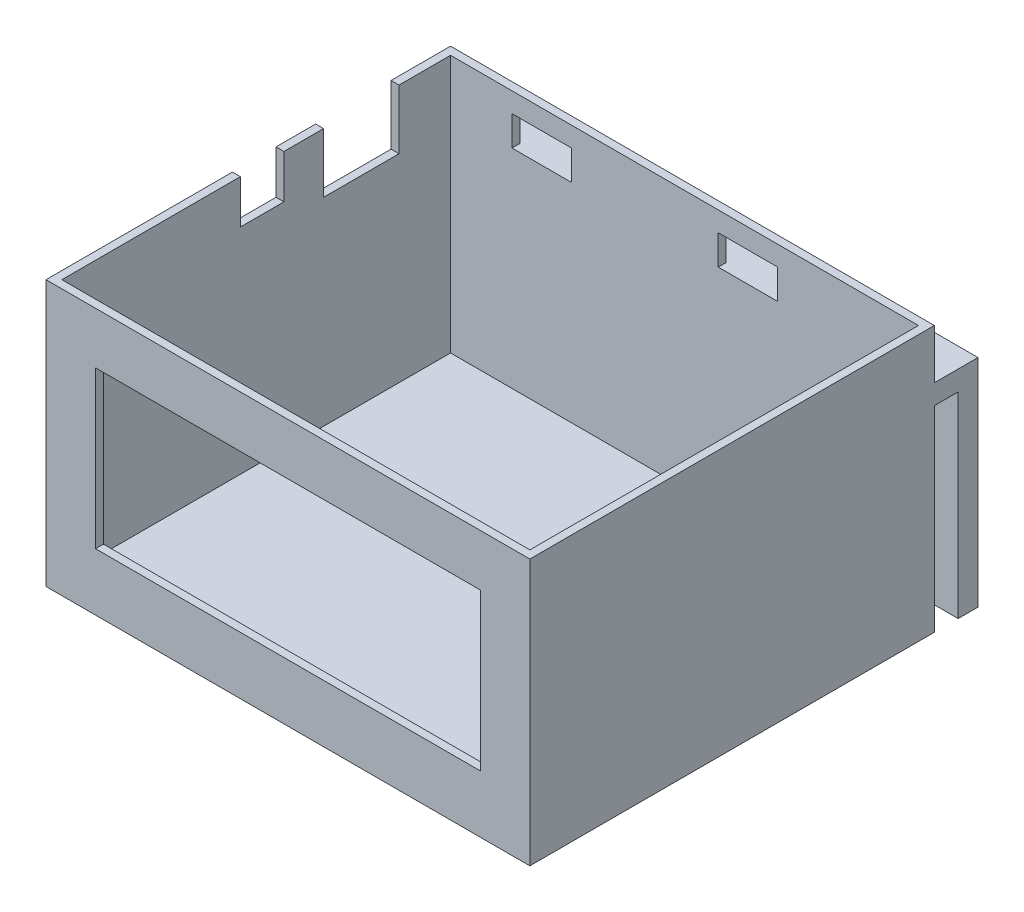
ISO-10303-21;
HEADER;
FILE_DESCRIPTION(('STEP AP214'),'2;1');
FILE_NAME('part.step','',(''),(''),'','','');
FILE_SCHEMA(('AUTOMOTIVE_DESIGN { 1 0 10303 214 1 1 1 1 }'));
ENDSEC;
DATA;
#1=APPLICATION_CONTEXT('core data for automotive mechanical design processes');
#2=APPLICATION_PROTOCOL_DEFINITION('international standard','automotive_design',2000,#1);
#3=PRODUCT_CONTEXT('',#1,'mechanical');
#4=PRODUCT('Part','Part','',(#3));
#5=PRODUCT_RELATED_PRODUCT_CATEGORY('part','',(#4));
#6=PRODUCT_DEFINITION_FORMATION('','',#4);
#7=PRODUCT_DEFINITION_CONTEXT('part definition',#1,'design');
#8=PRODUCT_DEFINITION('design','',#6,#7);
#9=PRODUCT_DEFINITION_SHAPE('','',#8);
#10=(LENGTH_UNIT() NAMED_UNIT(*) SI_UNIT(.MILLI.,.METRE.));
#11=(NAMED_UNIT(*) PLANE_ANGLE_UNIT() SI_UNIT($,.RADIAN.));
#12=(NAMED_UNIT(*) SI_UNIT($,.STERADIAN.) SOLID_ANGLE_UNIT());
#13=UNCERTAINTY_MEASURE_WITH_UNIT(LENGTH_MEASURE(1.E-05),#10,'distance_accuracy_value','');
#14=(GEOMETRIC_REPRESENTATION_CONTEXT(3) GLOBAL_UNCERTAINTY_ASSIGNED_CONTEXT((#13)) GLOBAL_UNIT_ASSIGNED_CONTEXT((#10,
#11,#12)) REPRESENTATION_CONTEXT('',''));
#15=CARTESIAN_POINT('',(0.,0.,0.));
#16=DIRECTION('',(0.,0.,1.));
#17=DIRECTION('',(1.,0.,0.));
#18=AXIS2_PLACEMENT_3D('',#15,#16,#17);
#19=CARTESIAN_POINT('',(0.,67.,0.));
#20=DIRECTION('',(0.,1.,0.));
#21=DIRECTION('',(0.,0.,1.));
#22=AXIS2_PLACEMENT_3D('',#19,#20,#21);
#23=PLANE('',#22);
#24=DIRECTION('',(-1.,0.,0.));
#25=VECTOR('',#24,1.);
#26=CARTESIAN_POINT('',(-4.52332657200814,67.,-13.1135902636917));
#27=LINE('',#26,#25);
#28=CARTESIAN_POINT('',(-52.5233265720081,67.,-13.1135902636917));
#29=VERTEX_POINT('',#28);
#30=CARTESIAN_POINT('',(-54.5233265720081,67.,-13.1135902636917));
#31=VERTEX_POINT('',#30);
#32=EDGE_CURVE('E294',#29,#31,#27,.T.);
#33=ORIENTED_EDGE('',*,*,#32,.F.);
#34=DIRECTION('',(0.,0.,1.));
#35=VECTOR('',#34,1.);
#36=CARTESIAN_POINT('',(-52.5233265720081,67.,-28.1135902636917));
#37=LINE('',#36,#35);
#38=CARTESIAN_POINT('',(-52.5233265720081,67.,-26.1135902636917));
#39=VERTEX_POINT('',#38);
#40=EDGE_CURVE('E540',#39,#29,#37,.T.);
#41=ORIENTED_EDGE('',*,*,#40,.F.);
#42=DIRECTION('',(-1.,0.,0.));
#43=VECTOR('',#42,1.);
#44=CARTESIAN_POINT('',(-54.5233265720081,67.,-26.1135902636917));
#45=LINE('',#44,#43);
#46=CARTESIAN_POINT('',(65.4766734279919,67.,-26.1135902636917));
#47=VERTEX_POINT('',#46);
#48=EDGE_CURVE('E524',#47,#39,#45,.T.);
#49=ORIENTED_EDGE('',*,*,#48,.F.);
#50=DIRECTION('',(0.,0.,-1.));
#51=VECTOR('',#50,1.);
#52=CARTESIAN_POINT('',(65.4766734279919,67.,-28.1135902636917));
#53=LINE('',#52,#51);
#54=CARTESIAN_POINT('',(65.4766734279919,67.,71.8864097363083));
#55=VERTEX_POINT('',#54);
#56=EDGE_CURVE('E548',#55,#47,#53,.T.);
#57=ORIENTED_EDGE('',*,*,#56,.F.);
#58=DIRECTION('',(1.,0.,0.));
#59=VECTOR('',#58,1.);
#60=CARTESIAN_POINT('',(-54.5233265720081,67.,71.8864097363083));
#61=LINE('',#60,#59);
#62=CARTESIAN_POINT('',(-52.5233265720081,67.,71.8864097363083));
#63=VERTEX_POINT('',#62);
#64=EDGE_CURVE('E544',#63,#55,#61,.T.);
#65=ORIENTED_EDGE('',*,*,#64,.F.);
#66=CARTESIAN_POINT('',(-52.5233265720081,67.,26.8864097363083));
#67=VERTEX_POINT('',#66);
#68=EDGE_CURVE('E539',#67,#63,#37,.T.);
#69=ORIENTED_EDGE('',*,*,#68,.F.);
#70=DIRECTION('',(-1.,0.,0.));
#71=VECTOR('',#70,1.);
#72=CARTESIAN_POINT('',(-4.52332657200814,67.,26.8864097363083));
#73=LINE('',#72,#71);
#74=CARTESIAN_POINT('',(-54.5233265720081,67.,26.8864097363083));
#75=VERTEX_POINT('',#74);
#76=EDGE_CURVE('E313',#67,#75,#73,.T.);
#77=ORIENTED_EDGE('',*,*,#76,.T.);
#78=DIRECTION('',(0.,0.,1.));
#79=VECTOR('',#78,1.);
#80=CARTESIAN_POINT('',(-54.5233265720081,67.,-28.1135902636917));
#81=LINE('',#80,#79);
#82=CARTESIAN_POINT('',(-54.5233265720081,67.,73.8864097363083));
#83=VERTEX_POINT('',#82);
#84=EDGE_CURVE('E559',#75,#83,#81,.T.);
#85=ORIENTED_EDGE('',*,*,#84,.T.);
#86=DIRECTION('',(1.,0.,0.));
#87=VECTOR('',#86,1.);
#88=CARTESIAN_POINT('',(-54.5233265720081,67.,73.8864097363083));
#89=LINE('',#88,#87);
#90=CARTESIAN_POINT('',(67.4766734279919,67.,73.8864097363083));
#91=VERTEX_POINT('',#90);
#92=EDGE_CURVE('E558',#83,#91,#89,.T.);
#93=ORIENTED_EDGE('',*,*,#92,.T.);
#94=DIRECTION('',(0.,0.,-1.));
#95=VECTOR('',#94,1.);
#96=CARTESIAN_POINT('',(67.4766734279919,67.,-28.1135902636917));
#97=LINE('',#96,#95);
#98=CARTESIAN_POINT('',(67.4766734279919,67.,-28.1135902636917));
#99=VERTEX_POINT('',#98);
#100=EDGE_CURVE('E562',#91,#99,#97,.T.);
#101=ORIENTED_EDGE('',*,*,#100,.T.);
#102=DIRECTION('',(-1.,0.,0.));
#103=VECTOR('',#102,1.);
#104=CARTESIAN_POINT('',(-54.5233265720081,67.,-28.1135902636917));
#105=LINE('',#104,#103);
#106=CARTESIAN_POINT('',(-54.5233265720081,67.,-28.1135902636917));
#107=VERTEX_POINT('',#106);
#108=EDGE_CURVE('E565',#99,#107,#105,.T.);
#109=ORIENTED_EDGE('',*,*,#108,.T.);
#110=EDGE_CURVE('E554',#107,#31,#81,.T.);
#111=ORIENTED_EDGE('',*,*,#110,.T.);
#112=EDGE_LOOP('',(#33,#41,#49,#57,#65,#69,#77,#85,#93,#101,#109,#111));
#113=FACE_BOUND('',#112,.T.);
#114=ADVANCED_FACE('F39',(#113),#23,.T.);
#115=CARTESIAN_POINT('',(67.4766734279919,49.5,-39.1135902636917));
#116=DIRECTION('',(0.,1.,0.));
#117=DIRECTION('',(0.,0.,1.));
#118=AXIS2_PLACEMENT_3D('',#115,#116,#117);
#119=PLANE('',#118);
#120=DIRECTION('',(-1.,0.,0.));
#121=VECTOR('',#120,1.);
#122=CARTESIAN_POINT('',(-54.5233265720081,49.5,-34.1135902636917));
#123=LINE('',#122,#121);
#124=CARTESIAN_POINT('',(67.4766734279919,49.5,-34.1135902636917));
#125=VERTEX_POINT('',#124);
#126=CARTESIAN_POINT('',(-54.5233265720081,49.5,-34.1135902636917));
#127=VERTEX_POINT('',#126);
#128=EDGE_CURVE('E338',#125,#127,#123,.T.);
#129=ORIENTED_EDGE('',*,*,#128,.F.);
#130=DIRECTION('',(0.,0.,1.));
#131=VECTOR('',#130,1.);
#132=CARTESIAN_POINT('',(67.4766734279919,49.5,-39.1135902636917));
#133=LINE('',#132,#131);
#134=CARTESIAN_POINT('',(67.4766734279919,49.5,-28.1135902636917));
#135=VERTEX_POINT('',#134);
#136=EDGE_CURVE('E388',#125,#135,#133,.T.);
#137=ORIENTED_EDGE('',*,*,#136,.T.);
#138=DIRECTION('',(-1.,0.,0.));
#139=VECTOR('',#138,1.);
#140=CARTESIAN_POINT('',(67.4766734279919,49.5,-28.1135902636917));
#141=LINE('',#140,#139);
#142=CARTESIAN_POINT('',(-54.5233265720081,49.5,-28.1135902636917));
#143=VERTEX_POINT('',#142);
#144=EDGE_CURVE('E362',#135,#143,#141,.T.);
#145=ORIENTED_EDGE('',*,*,#144,.T.);
#146=DIRECTION('',(0.,0.,1.));
#147=VECTOR('',#146,1.);
#148=CARTESIAN_POINT('',(-54.5233265720081,49.5,-39.1135902636917));
#149=LINE('',#148,#147);
#150=EDGE_CURVE('E385',#127,#143,#149,.T.);
#151=ORIENTED_EDGE('',*,*,#150,.F.);
#152=EDGE_LOOP('',(#129,#137,#145,#151));
#153=FACE_BOUND('',#152,.T.);
#154=ADVANCED_FACE('F672',(#153),#119,.F.);
#155=CARTESIAN_POINT('',(-54.5233265720081,67.,-28.1135902636917));
#156=DIRECTION('',(0.,0.,1.));
#157=DIRECTION('',(1.,0.,0.));
#158=AXIS2_PLACEMENT_3D('',#155,#156,#157);
#159=PLANE('',#158);
#160=DIRECTION('',(1.,0.,0.));
#161=VECTOR('',#160,1.);
#162=CARTESIAN_POINT('',(67.4766734279919,54.5,-28.1135902636917));
#163=LINE('',#162,#161);
#164=CARTESIAN_POINT('',(-54.5233265720081,54.5,-28.1135902636917));
#165=VERTEX_POINT('',#164);
#166=CARTESIAN_POINT('',(-37.0233265720081,54.5,-28.1135902636917));
#167=VERTEX_POINT('',#166);
#168=EDGE_CURVE('E51',#165,#167,#163,.T.);
#169=ORIENTED_EDGE('',*,*,#168,.F.);
#170=DIRECTION('',(0.,-1.,0.));
#171=VECTOR('',#170,1.);
#172=CARTESIAN_POINT('',(-54.5233265720081,67.,-28.1135902636917));
#173=LINE('',#172,#171);
#174=EDGE_CURVE('E583',#107,#165,#173,.T.);
#175=ORIENTED_EDGE('',*,*,#174,.F.);
#176=ORIENTED_EDGE('',*,*,#108,.F.);
#177=DIRECTION('',(0.,-1.,0.));
#178=VECTOR('',#177,1.);
#179=CARTESIAN_POINT('',(67.4766734279919,67.,-28.1135902636917));
#180=LINE('',#179,#178);
#181=CARTESIAN_POINT('',(67.4766734279919,54.5,-28.1135902636917));
#182=VERTEX_POINT('',#181);
#183=EDGE_CURVE('E588',#99,#182,#180,.T.);
#184=ORIENTED_EDGE('',*,*,#183,.T.);
#185=CARTESIAN_POINT('',(29.9766734279919,54.5,-28.1135902636917));
#186=VERTEX_POINT('',#185);
#187=EDGE_CURVE('E49',#186,#182,#163,.T.);
#188=ORIENTED_EDGE('',*,*,#187,.F.);
#189=DIRECTION('',(0.,-1.,0.));
#190=VECTOR('',#189,1.);
#191=CARTESIAN_POINT('',(29.9766734279919,62.,-28.1135902636917));
#192=LINE('',#191,#190);
#193=CARTESIAN_POINT('',(29.9766734279919,62.,-28.1135902636917));
#194=VERTEX_POINT('',#193);
#195=EDGE_CURVE('E392',#194,#186,#192,.T.);
#196=ORIENTED_EDGE('',*,*,#195,.F.);
#197=DIRECTION('',(1.,0.,0.));
#198=VECTOR('',#197,1.);
#199=CARTESIAN_POINT('',(29.9766734279919,62.,-28.1135902636917));
#200=LINE('',#199,#198);
#201=CARTESIAN_POINT('',(14.9766734279919,62.,-28.1135902636917));
#202=VERTEX_POINT('',#201);
#203=EDGE_CURVE('E401',#202,#194,#200,.T.);
#204=ORIENTED_EDGE('',*,*,#203,.F.);
#205=DIRECTION('',(0.,1.,0.));
#206=VECTOR('',#205,1.);
#207=CARTESIAN_POINT('',(14.9766734279919,62.,-28.1135902636917));
#208=LINE('',#207,#206);
#209=CARTESIAN_POINT('',(14.9766734279919,54.5,-28.1135902636917));
#210=VERTEX_POINT('',#209);
#211=EDGE_CURVE('E396',#210,#202,#208,.T.);
#212=ORIENTED_EDGE('',*,*,#211,.F.);
#213=CARTESIAN_POINT('',(-22.0233265720081,54.5,-28.1135902636917));
#214=VERTEX_POINT('',#213);
#215=EDGE_CURVE('E11',#214,#210,#163,.T.);
#216=ORIENTED_EDGE('',*,*,#215,.F.);
#217=DIRECTION('',(0.,-1.,0.));
#218=VECTOR('',#217,1.);
#219=CARTESIAN_POINT('',(-22.0233265720081,54.5,-28.1135902636917));
#220=LINE('',#219,#218);
#221=CARTESIAN_POINT('',(-22.0233265720081,62.,-28.1135902636917));
#222=VERTEX_POINT('',#221);
#223=EDGE_CURVE('E391',#222,#214,#220,.T.);
#224=ORIENTED_EDGE('',*,*,#223,.F.);
#225=DIRECTION('',(1.,0.,0.));
#226=VECTOR('',#225,1.);
#227=CARTESIAN_POINT('',(-22.0233265720081,62.,-28.1135902636917));
#228=LINE('',#227,#226);
#229=CARTESIAN_POINT('',(-37.0233265720081,62.,-28.1135902636917));
#230=VERTEX_POINT('',#229);
#231=EDGE_CURVE('E426',#230,#222,#228,.T.);
#232=ORIENTED_EDGE('',*,*,#231,.F.);
#233=DIRECTION('',(0.,1.,0.));
#234=VECTOR('',#233,1.);
#235=CARTESIAN_POINT('',(-37.0233265720081,54.5,-28.1135902636917));
#236=LINE('',#235,#234);
#237=EDGE_CURVE('E422',#167,#230,#236,.T.);
#238=ORIENTED_EDGE('',*,*,#237,.F.);
#239=EDGE_LOOP('',(#169,#175,#176,#184,#188,#196,#204,#212,#216,#224,#232,#238));
#240=FACE_BOUND('',#239,.T.);
#241=ADVANCED_FACE('F630',(#240),#159,.F.);
#242=ORIENTED_EDGE('',*,*,#144,.F.);
#243=CARTESIAN_POINT('',(67.4766734279919,0.,-28.1135902636917));
#244=VERTEX_POINT('',#243);
#245=EDGE_CURVE('E587',#135,#244,#180,.T.);
#246=ORIENTED_EDGE('',*,*,#245,.T.);
#247=DIRECTION('',(-1.,0.,0.));
#248=VECTOR('',#247,1.);
#249=CARTESIAN_POINT('',(-54.5233265720081,0.,-28.1135902636917));
#250=LINE('',#249,#248);
#251=CARTESIAN_POINT('',(-54.5233265720081,0.,-28.1135902636917));
#252=VERTEX_POINT('',#251);
#253=EDGE_CURVE('E579',#244,#252,#250,.T.);
#254=ORIENTED_EDGE('',*,*,#253,.T.);
#255=EDGE_CURVE('E568',#143,#252,#173,.T.);
#256=ORIENTED_EDGE('',*,*,#255,.F.);
#257=EDGE_LOOP('',(#242,#246,#254,#256));
#258=FACE_BOUND('',#257,.T.);
#259=ADVANCED_FACE('F686',(#258),#159,.F.);
#260=DIRECTION('',(-1.,0.,0.));
#261=VECTOR('',#260,1.);
#262=CARTESIAN_POINT('',(-4.52332657200814,67.,5.88640973630831));
#263=LINE('',#262,#261);
#264=CARTESIAN_POINT('',(-52.5233265720081,67.,5.88640973630832));
#265=VERTEX_POINT('',#264);
#266=CARTESIAN_POINT('',(-54.5233265720081,67.,5.88640973630832));
#267=VERTEX_POINT('',#266);
#268=EDGE_CURVE('E276',#265,#267,#263,.T.);
#269=ORIENTED_EDGE('',*,*,#268,.T.);
#270=CARTESIAN_POINT('',(-54.5233265720081,67.,15.8864097363083));
#271=VERTEX_POINT('',#270);
#272=EDGE_CURVE('E287',#267,#271,#81,.T.);
#273=ORIENTED_EDGE('',*,*,#272,.T.);
#274=DIRECTION('',(-1.,0.,0.));
#275=VECTOR('',#274,1.);
#276=CARTESIAN_POINT('',(-4.52332657200814,67.,15.8864097363083));
#277=LINE('',#276,#275);
#278=CARTESIAN_POINT('',(-52.5233265720081,67.,15.8864097363083));
#279=VERTEX_POINT('',#278);
#280=EDGE_CURVE('E310',#279,#271,#277,.T.);
#281=ORIENTED_EDGE('',*,*,#280,.F.);
#282=EDGE_CURVE('E545',#265,#279,#37,.T.);
#283=ORIENTED_EDGE('',*,*,#282,.F.);
#284=EDGE_LOOP('',(#269,#273,#281,#283));
#285=FACE_BOUND('',#284,.T.);
#286=ADVANCED_FACE('F675',(#285),#23,.T.);
#287=CARTESIAN_POINT('',(-54.5233265720081,67.,71.8864097363083));
#288=DIRECTION('',(0.,0.,-1.));
#289=DIRECTION('',(-1.,0.,0.));
#290=AXIS2_PLACEMENT_3D('',#287,#288,#289);
#291=PLANE('',#290);
#292=DIRECTION('',(0.,1.,0.));
#293=VECTOR('',#292,1.);
#294=CARTESIAN_POINT('',(-42.0233265720081,67.,71.8864097363083));
#295=LINE('',#294,#293);
#296=CARTESIAN_POINT('',(-42.0233265720081,14.5,71.8864097363083));
#297=VERTEX_POINT('',#296);
#298=CARTESIAN_POINT('',(-42.0233265720081,54.,71.8864097363083));
#299=VERTEX_POINT('',#298);
#300=EDGE_CURVE('E505',#297,#299,#295,.T.);
#301=ORIENTED_EDGE('',*,*,#300,.F.);
#302=DIRECTION('',(-1.,0.,0.));
#303=VECTOR('',#302,1.);
#304=CARTESIAN_POINT('',(-54.5233265720081,14.5,71.8864097363083));
#305=LINE('',#304,#303);
#306=CARTESIAN_POINT('',(54.9766734279919,14.5,71.8864097363083));
#307=VERTEX_POINT('',#306);
#308=EDGE_CURVE('E486',#307,#297,#305,.T.);
#309=ORIENTED_EDGE('',*,*,#308,.F.);
#310=DIRECTION('',(0.,-1.,0.));
#311=VECTOR('',#310,1.);
#312=CARTESIAN_POINT('',(54.9766734279919,67.,71.8864097363083));
#313=LINE('',#312,#311);
#314=CARTESIAN_POINT('',(54.9766734279919,54.,71.8864097363083));
#315=VERTEX_POINT('',#314);
#316=EDGE_CURVE('E498',#315,#307,#313,.T.);
#317=ORIENTED_EDGE('',*,*,#316,.F.);
#318=DIRECTION('',(1.,0.,0.));
#319=VECTOR('',#318,1.);
#320=CARTESIAN_POINT('',(-54.5233265720081,54.,71.8864097363083));
#321=LINE('',#320,#319);
#322=EDGE_CURVE('E502',#299,#315,#321,.T.);
#323=ORIENTED_EDGE('',*,*,#322,.F.);
#324=EDGE_LOOP('',(#301,#309,#317,#323));
#325=FACE_BOUND('',#324,.T.);
#326=DIRECTION('',(1.,0.,0.));
#327=VECTOR('',#326,1.);
#328=CARTESIAN_POINT('',(-54.5233265720081,2.,71.8864097363083));
#329=LINE('',#328,#327);
#330=CARTESIAN_POINT('',(-52.5233265720081,2.,71.8864097363083));
#331=VERTEX_POINT('',#330);
#332=CARTESIAN_POINT('',(65.4766734279919,2.,71.8864097363083));
#333=VERTEX_POINT('',#332);
#334=EDGE_CURVE('E512',#331,#333,#329,.T.);
#335=ORIENTED_EDGE('',*,*,#334,.F.);
#336=DIRECTION('',(0.,-1.,0.));
#337=VECTOR('',#336,1.);
#338=CARTESIAN_POINT('',(-52.5233265720081,67.,71.8864097363083));
#339=LINE('',#338,#337);
#340=EDGE_CURVE('E513',#63,#331,#339,.T.);
#341=ORIENTED_EDGE('',*,*,#340,.F.);
#342=ORIENTED_EDGE('',*,*,#64,.T.);
#343=DIRECTION('',(0.,-1.,0.));
#344=VECTOR('',#343,1.);
#345=CARTESIAN_POINT('',(65.4766734279919,67.,71.8864097363083));
#346=LINE('',#345,#344);
#347=EDGE_CURVE('E518',#55,#333,#346,.T.);
#348=ORIENTED_EDGE('',*,*,#347,.T.);
#349=EDGE_LOOP('',(#335,#341,#342,#348));
#350=FACE_BOUND('',#349,.T.);
#351=ADVANCED_FACE('F685',(#325,#350),#291,.T.);
#352=CARTESIAN_POINT('',(-52.5233265720081,67.,-28.1135902636917));
#353=DIRECTION('',(1.,0.,0.));
#354=DIRECTION('',(0.,0.,-1.));
#355=AXIS2_PLACEMENT_3D('',#352,#353,#354);
#356=PLANE('',#355);
#357=DIRECTION('',(0.,1.,0.));
#358=VECTOR('',#357,1.);
#359=CARTESIAN_POINT('',(-52.5233265720081,67.,-13.1135902636917));
#360=LINE('',#359,#358);
#361=CARTESIAN_POINT('',(-52.5233265720081,52.,-13.1135902636917));
#362=VERTEX_POINT('',#361);
#363=EDGE_CURVE('E335',#362,#29,#360,.T.);
#364=ORIENTED_EDGE('',*,*,#363,.F.);
#365=DIRECTION('',(0.,0.,-1.));
#366=VECTOR('',#365,1.);
#367=CARTESIAN_POINT('',(-52.5233265720081,52.,-28.1135902636917));
#368=LINE('',#367,#366);
#369=CARTESIAN_POINT('',(-52.5233265720081,52.,5.88640973630832));
#370=VERTEX_POINT('',#369);
#371=EDGE_CURVE('E330',#370,#362,#368,.T.);
#372=ORIENTED_EDGE('',*,*,#371,.F.);
#373=DIRECTION('',(0.,-1.,0.));
#374=VECTOR('',#373,1.);
#375=CARTESIAN_POINT('',(-52.5233265720081,67.,5.88640973630831));
#376=LINE('',#375,#374);
#377=EDGE_CURVE('E272',#265,#370,#376,.T.);
#378=ORIENTED_EDGE('',*,*,#377,.F.);
#379=ORIENTED_EDGE('',*,*,#282,.T.);
#380=DIRECTION('',(0.,1.,0.));
#381=VECTOR('',#380,1.);
#382=CARTESIAN_POINT('',(-52.5233265720081,67.,15.8864097363083));
#383=LINE('',#382,#381);
#384=CARTESIAN_POINT('',(-52.5233265720081,56.,15.8864097363083));
#385=VERTEX_POINT('',#384);
#386=EDGE_CURVE('E327',#385,#279,#383,.T.);
#387=ORIENTED_EDGE('',*,*,#386,.F.);
#388=DIRECTION('',(0.,0.,-1.));
#389=VECTOR('',#388,1.);
#390=CARTESIAN_POINT('',(-52.5233265720081,56.,-28.1135902636917));
#391=LINE('',#390,#389);
#392=CARTESIAN_POINT('',(-52.5233265720081,56.,26.8864097363083));
#393=VERTEX_POINT('',#392);
#394=EDGE_CURVE('E297',#393,#385,#391,.T.);
#395=ORIENTED_EDGE('',*,*,#394,.F.);
#396=DIRECTION('',(0.,-1.,0.));
#397=VECTOR('',#396,1.);
#398=CARTESIAN_POINT('',(-52.5233265720081,67.,26.8864097363083));
#399=LINE('',#398,#397);
#400=EDGE_CURVE('E324',#67,#393,#399,.T.);
#401=ORIENTED_EDGE('',*,*,#400,.F.);
#402=ORIENTED_EDGE('',*,*,#68,.T.);
#403=ORIENTED_EDGE('',*,*,#340,.T.);
#404=DIRECTION('',(0.,0.,1.));
#405=VECTOR('',#404,1.);
#406=CARTESIAN_POINT('',(-52.5233265720081,2.,-28.1135902636917));
#407=LINE('',#406,#405);
#408=CARTESIAN_POINT('',(-52.5233265720081,2.,-26.1135902636917));
#409=VERTEX_POINT('',#408);
#410=EDGE_CURVE('E508',#409,#331,#407,.T.);
#411=ORIENTED_EDGE('',*,*,#410,.F.);
#412=DIRECTION('',(0.,-1.,0.));
#413=VECTOR('',#412,1.);
#414=CARTESIAN_POINT('',(-52.5233265720081,67.,-26.1135902636917));
#415=LINE('',#414,#413);
#416=EDGE_CURVE('E519',#39,#409,#415,.T.);
#417=ORIENTED_EDGE('',*,*,#416,.F.);
#418=ORIENTED_EDGE('',*,*,#40,.T.);
#419=EDGE_LOOP('',(#364,#372,#378,#379,#387,#395,#401,#402,#403,#411,#417,#418));
#420=FACE_BOUND('',#419,.T.);
#421=ADVANCED_FACE('F692',(#420),#356,.T.);
#422=CARTESIAN_POINT('',(65.4766734279919,67.,-28.1135902636917));
#423=DIRECTION('',(-1.,0.,0.));
#424=DIRECTION('',(0.,0.,1.));
#425=AXIS2_PLACEMENT_3D('',#422,#423,#424);
#426=PLANE('',#425);
#427=DIRECTION('',(0.,0.,-1.));
#428=VECTOR('',#427,1.);
#429=CARTESIAN_POINT('',(65.4766734279919,2.,-28.1135902636917));
#430=LINE('',#429,#428);
#431=CARTESIAN_POINT('',(65.4766734279919,2.,-26.1135902636917));
#432=VERTEX_POINT('',#431);
#433=EDGE_CURVE('E527',#333,#432,#430,.T.);
#434=ORIENTED_EDGE('',*,*,#433,.F.);
#435=ORIENTED_EDGE('',*,*,#347,.F.);
#436=ORIENTED_EDGE('',*,*,#56,.T.);
#437=DIRECTION('',(0.,-1.,0.));
#438=VECTOR('',#437,1.);
#439=CARTESIAN_POINT('',(65.4766734279919,67.,-26.1135902636917));
#440=LINE('',#439,#438);
#441=EDGE_CURVE('E523',#47,#432,#440,.T.);
#442=ORIENTED_EDGE('',*,*,#441,.T.);
#443=EDGE_LOOP('',(#434,#435,#436,#442));
#444=FACE_BOUND('',#443,.T.);
#445=ADVANCED_FACE('F708',(#444),#426,.T.);
#446=CARTESIAN_POINT('',(0.,2.,0.));
#447=DIRECTION('',(0.,1.,0.));
#448=DIRECTION('',(0.,0.,1.));
#449=AXIS2_PLACEMENT_3D('',#446,#447,#448);
#450=PLANE('',#449);
#451=ORIENTED_EDGE('',*,*,#410,.T.);
#452=ORIENTED_EDGE('',*,*,#334,.T.);
#453=ORIENTED_EDGE('',*,*,#433,.T.);
#454=DIRECTION('',(-1.,0.,0.));
#455=VECTOR('',#454,1.);
#456=CARTESIAN_POINT('',(-54.5233265720081,2.,-26.1135902636917));
#457=LINE('',#456,#455);
#458=EDGE_CURVE('E533',#432,#409,#457,.T.);
#459=ORIENTED_EDGE('',*,*,#458,.T.);
#460=EDGE_LOOP('',(#451,#452,#453,#459));
#461=FACE_BOUND('',#460,.T.);
#462=ADVANCED_FACE('F701',(#461),#450,.T.);
#463=CARTESIAN_POINT('',(-54.5233265720081,67.,-26.1135902636917));
#464=DIRECTION('',(0.,0.,1.));
#465=DIRECTION('',(1.,0.,0.));
#466=AXIS2_PLACEMENT_3D('',#463,#464,#465);
#467=PLANE('',#466);
#468=DIRECTION('',(0.,1.,0.));
#469=VECTOR('',#468,1.);
#470=CARTESIAN_POINT('',(29.9766734279919,67.,-26.1135902636917));
#471=LINE('',#470,#469);
#472=CARTESIAN_POINT('',(29.9766734279919,54.5,-26.1135902636917));
#473=VERTEX_POINT('',#472);
#474=CARTESIAN_POINT('',(29.9766734279919,62.,-26.1135902636917));
#475=VERTEX_POINT('',#474);
#476=EDGE_CURVE('E464',#473,#475,#471,.T.);
#477=ORIENTED_EDGE('',*,*,#476,.F.);
#478=DIRECTION('',(1.,0.,0.));
#479=VECTOR('',#478,1.);
#480=CARTESIAN_POINT('',(-54.5233265720081,54.5,-26.1135902636917));
#481=LINE('',#480,#479);
#482=CARTESIAN_POINT('',(14.9766734279919,54.5,-26.1135902636917));
#483=VERTEX_POINT('',#482);
#484=EDGE_CURVE('E454',#483,#473,#481,.T.);
#485=ORIENTED_EDGE('',*,*,#484,.F.);
#486=DIRECTION('',(0.,-1.,0.));
#487=VECTOR('',#486,1.);
#488=CARTESIAN_POINT('',(14.9766734279919,67.,-26.1135902636917));
#489=LINE('',#488,#487);
#490=CARTESIAN_POINT('',(14.9766734279919,62.,-26.1135902636917));
#491=VERTEX_POINT('',#490);
#492=EDGE_CURVE('E457',#491,#483,#489,.T.);
#493=ORIENTED_EDGE('',*,*,#492,.F.);
#494=DIRECTION('',(-1.,0.,0.));
#495=VECTOR('',#494,1.);
#496=CARTESIAN_POINT('',(-54.5233265720081,62.,-26.1135902636917));
#497=LINE('',#496,#495);
#498=EDGE_CURVE('E461',#475,#491,#497,.T.);
#499=ORIENTED_EDGE('',*,*,#498,.F.);
#500=EDGE_LOOP('',(#477,#485,#493,#499));
#501=FACE_BOUND('',#500,.T.);
#502=DIRECTION('',(0.,1.,0.));
#503=VECTOR('',#502,1.);
#504=CARTESIAN_POINT('',(-22.0233265720081,67.,-26.1135902636917));
#505=LINE('',#504,#503);
#506=CARTESIAN_POINT('',(-22.0233265720081,54.5,-26.1135902636917));
#507=VERTEX_POINT('',#506);
#508=CARTESIAN_POINT('',(-22.0233265720081,62.,-26.1135902636917));
#509=VERTEX_POINT('',#508);
#510=EDGE_CURVE('E451',#507,#509,#505,.T.);
#511=ORIENTED_EDGE('',*,*,#510,.F.);
#512=DIRECTION('',(1.,0.,0.));
#513=VECTOR('',#512,1.);
#514=CARTESIAN_POINT('',(-54.5233265720081,54.5,-26.1135902636917));
#515=LINE('',#514,#513);
#516=CARTESIAN_POINT('',(-37.0233265720081,54.5,-26.1135902636917));
#517=VERTEX_POINT('',#516);
#518=EDGE_CURVE('E409',#517,#507,#515,.T.);
#519=ORIENTED_EDGE('',*,*,#518,.F.);
#520=DIRECTION('',(0.,-1.,0.));
#521=VECTOR('',#520,1.);
#522=CARTESIAN_POINT('',(-37.0233265720081,67.,-26.1135902636917));
#523=LINE('',#522,#521);
#524=CARTESIAN_POINT('',(-37.0233265720081,62.,-26.1135902636917));
#525=VERTEX_POINT('',#524);
#526=EDGE_CURVE('E444',#525,#517,#523,.T.);
#527=ORIENTED_EDGE('',*,*,#526,.F.);
#528=DIRECTION('',(-1.,0.,0.));
#529=VECTOR('',#528,1.);
#530=CARTESIAN_POINT('',(-54.5233265720081,62.,-26.1135902636917));
#531=LINE('',#530,#529);
#532=EDGE_CURVE('E448',#509,#525,#531,.T.);
#533=ORIENTED_EDGE('',*,*,#532,.F.);
#534=EDGE_LOOP('',(#511,#519,#527,#533));
#535=FACE_BOUND('',#534,.T.);
#536=ORIENTED_EDGE('',*,*,#458,.F.);
#537=ORIENTED_EDGE('',*,*,#441,.F.);
#538=ORIENTED_EDGE('',*,*,#48,.T.);
#539=ORIENTED_EDGE('',*,*,#416,.T.);
#540=EDGE_LOOP('',(#536,#537,#538,#539));
#541=FACE_BOUND('',#540,.T.);
#542=ADVANCED_FACE('F641',(#501,#535,#541),#467,.T.);
#543=CARTESIAN_POINT('',(-54.5233265720081,67.,-28.1135902636917));
#544=DIRECTION('',(1.,0.,0.));
#545=DIRECTION('',(0.,0.,-1.));
#546=AXIS2_PLACEMENT_3D('',#543,#544,#545);
#547=PLANE('',#546);
#548=DIRECTION('',(0.,0.,1.));
#549=VECTOR('',#548,1.);
#550=CARTESIAN_POINT('',(-54.5233265720081,52.,-13.1135902636917));
#551=LINE('',#550,#549);
#552=CARTESIAN_POINT('',(-54.5233265720081,52.,-13.1135902636917));
#553=VERTEX_POINT('',#552);
#554=CARTESIAN_POINT('',(-54.5233265720081,52.,5.88640973630832));
#555=VERTEX_POINT('',#554);
#556=EDGE_CURVE('E280',#553,#555,#551,.T.);
#557=ORIENTED_EDGE('',*,*,#556,.F.);
#558=DIRECTION('',(0.,-1.,0.));
#559=VECTOR('',#558,1.);
#560=CARTESIAN_POINT('',(-54.5233265720081,67.,-13.1135902636917));
#561=LINE('',#560,#559);
#562=EDGE_CURVE('E58',#31,#553,#561,.T.);
#563=ORIENTED_EDGE('',*,*,#562,.F.);
#564=ORIENTED_EDGE('',*,*,#110,.F.);
#565=ORIENTED_EDGE('',*,*,#174,.T.);
#566=DIRECTION('',(0.,0.,1.));
#567=VECTOR('',#566,1.);
#568=CARTESIAN_POINT('',(-54.5233265720081,54.5,-39.1135902636917));
#569=LINE('',#568,#567);
#570=CARTESIAN_POINT('',(-54.5233265720081,54.5,-39.1135902636917));
#571=VERTEX_POINT('',#570);
#572=EDGE_CURVE('E381',#571,#165,#569,.T.);
#573=ORIENTED_EDGE('',*,*,#572,.F.);
#574=DIRECTION('',(0.,1.,0.));
#575=VECTOR('',#574,1.);
#576=CARTESIAN_POINT('',(-54.5233265720081,54.5,-39.1135902636917));
#577=LINE('',#576,#575);
#578=CARTESIAN_POINT('',(-54.5233265720081,0.,-39.1135902636917));
#579=VERTEX_POINT('',#578);
#580=EDGE_CURVE('E366',#579,#571,#577,.T.);
#581=ORIENTED_EDGE('',*,*,#580,.F.);
#582=DIRECTION('',(0.,0.,-1.));
#583=VECTOR('',#582,1.);
#584=CARTESIAN_POINT('',(-54.5233265720081,0.,-39.1135902636917));
#585=LINE('',#584,#583);
#586=CARTESIAN_POINT('',(-54.5233265720081,0.,-34.1135902636917));
#587=VERTEX_POINT('',#586);
#588=EDGE_CURVE('E339',#587,#579,#585,.T.);
#589=ORIENTED_EDGE('',*,*,#588,.F.);
#590=DIRECTION('',(0.,1.,0.));
#591=VECTOR('',#590,1.);
#592=CARTESIAN_POINT('',(-54.5233265720081,0.,-34.1135902636917));
#593=LINE('',#592,#591);
#594=EDGE_CURVE('E353',#587,#127,#593,.T.);
#595=ORIENTED_EDGE('',*,*,#594,.T.);
#596=ORIENTED_EDGE('',*,*,#150,.T.);
#597=ORIENTED_EDGE('',*,*,#255,.T.);
#598=DIRECTION('',(0.,0.,1.));
#599=VECTOR('',#598,1.);
#600=CARTESIAN_POINT('',(-54.5233265720081,0.,-28.1135902636917));
#601=LINE('',#600,#599);
#602=CARTESIAN_POINT('',(-54.5233265720081,0.,73.8864097363083));
#603=VERTEX_POINT('',#602);
#604=EDGE_CURVE('E517',#252,#603,#601,.T.);
#605=ORIENTED_EDGE('',*,*,#604,.T.);
#606=DIRECTION('',(0.,-1.,0.));
#607=VECTOR('',#606,1.);
#608=CARTESIAN_POINT('',(-54.5233265720081,67.,73.8864097363083));
#609=LINE('',#608,#607);
#610=EDGE_CURVE('E43',#83,#603,#609,.T.);
#611=ORIENTED_EDGE('',*,*,#610,.F.);
#612=ORIENTED_EDGE('',*,*,#84,.F.);
#613=DIRECTION('',(0.,1.,0.));
#614=VECTOR('',#613,1.);
#615=CARTESIAN_POINT('',(-54.5233265720081,67.,26.8864097363083));
#616=LINE('',#615,#614);
#617=CARTESIAN_POINT('',(-54.5233265720081,56.,26.8864097363083));
#618=VERTEX_POINT('',#617);
#619=EDGE_CURVE('E306',#618,#75,#616,.T.);
#620=ORIENTED_EDGE('',*,*,#619,.F.);
#621=DIRECTION('',(0.,0.,1.));
#622=VECTOR('',#621,1.);
#623=CARTESIAN_POINT('',(-54.5233265720081,56.,15.8864097363083));
#624=LINE('',#623,#622);
#625=CARTESIAN_POINT('',(-54.5233265720081,56.,15.8864097363083));
#626=VERTEX_POINT('',#625);
#627=EDGE_CURVE('E302',#626,#618,#624,.T.);
#628=ORIENTED_EDGE('',*,*,#627,.F.);
#629=DIRECTION('',(0.,-1.,0.));
#630=VECTOR('',#629,1.);
#631=CARTESIAN_POINT('',(-54.5233265720081,67.,15.8864097363083));
#632=LINE('',#631,#630);
#633=EDGE_CURVE('E66',#271,#626,#632,.T.);
#634=ORIENTED_EDGE('',*,*,#633,.F.);
#635=ORIENTED_EDGE('',*,*,#272,.F.);
#636=DIRECTION('',(0.,1.,0.));
#637=VECTOR('',#636,1.);
#638=CARTESIAN_POINT('',(-54.5233265720081,67.,5.88640973630832));
#639=LINE('',#638,#637);
#640=EDGE_CURVE('E269',#555,#267,#639,.T.);
#641=ORIENTED_EDGE('',*,*,#640,.F.);
#642=EDGE_LOOP('',(#557,#563,#564,#565,#573,#581,#589,#595,#596,#597,#605,#611,#612,#620,#628,
#634,#635,#641));
#643=FACE_BOUND('',#642,.T.);
#644=ADVANCED_FACE('F41',(#643),#547,.F.);
#645=CARTESIAN_POINT('',(-54.5233265720081,67.,73.8864097363083));
#646=DIRECTION('',(0.,0.,-1.));
#647=DIRECTION('',(-1.,0.,0.));
#648=AXIS2_PLACEMENT_3D('',#645,#646,#647);
#649=PLANE('',#648);
#650=DIRECTION('',(1.,0.,0.));
#651=VECTOR('',#650,1.);
#652=CARTESIAN_POINT('',(-42.0233265720081,14.5,73.8864097363083));
#653=LINE('',#652,#651);
#654=CARTESIAN_POINT('',(-42.0233265720081,14.5,73.8864097363083));
#655=VERTEX_POINT('',#654);
#656=CARTESIAN_POINT('',(54.9766734279919,14.5,73.8864097363083));
#657=VERTEX_POINT('',#656);
#658=EDGE_CURVE('E470',#655,#657,#653,.T.);
#659=ORIENTED_EDGE('',*,*,#658,.F.);
#660=DIRECTION('',(0.,-1.,0.));
#661=VECTOR('',#660,1.);
#662=CARTESIAN_POINT('',(-42.0233265720081,54.,73.8864097363083));
#663=LINE('',#662,#661);
#664=CARTESIAN_POINT('',(-42.0233265720081,54.,73.8864097363083));
#665=VERTEX_POINT('',#664);
#666=EDGE_CURVE('E467',#665,#655,#663,.T.);
#667=ORIENTED_EDGE('',*,*,#666,.F.);
#668=DIRECTION('',(-1.,0.,0.));
#669=VECTOR('',#668,1.);
#670=CARTESIAN_POINT('',(-42.0233265720081,54.,73.8864097363083));
#671=LINE('',#670,#669);
#672=CARTESIAN_POINT('',(54.9766734279919,54.,73.8864097363083));
#673=VERTEX_POINT('',#672);
#674=EDGE_CURVE('E478',#673,#665,#671,.T.);
#675=ORIENTED_EDGE('',*,*,#674,.F.);
#676=DIRECTION('',(0.,1.,0.));
#677=VECTOR('',#676,1.);
#678=CARTESIAN_POINT('',(54.9766734279919,54.,73.8864097363083));
#679=LINE('',#678,#677);
#680=EDGE_CURVE('E474',#657,#673,#679,.T.);
#681=ORIENTED_EDGE('',*,*,#680,.F.);
#682=EDGE_LOOP('',(#659,#667,#675,#681));
#683=FACE_BOUND('',#682,.T.);
#684=DIRECTION('',(1.,0.,0.));
#685=VECTOR('',#684,1.);
#686=CARTESIAN_POINT('',(-54.5233265720081,0.,73.8864097363083));
#687=LINE('',#686,#685);
#688=CARTESIAN_POINT('',(67.4766734279919,0.,73.8864097363083));
#689=VERTEX_POINT('',#688);
#690=EDGE_CURVE('E572',#603,#689,#687,.T.);
#691=ORIENTED_EDGE('',*,*,#690,.T.);
#692=DIRECTION('',(0.,-1.,0.));
#693=VECTOR('',#692,1.);
#694=CARTESIAN_POINT('',(67.4766734279919,67.,73.8864097363083));
#695=LINE('',#694,#693);
#696=EDGE_CURVE('E590',#91,#689,#695,.T.);
#697=ORIENTED_EDGE('',*,*,#696,.F.);
#698=ORIENTED_EDGE('',*,*,#92,.F.);
#699=ORIENTED_EDGE('',*,*,#610,.T.);
#700=EDGE_LOOP('',(#691,#697,#698,#699));
#701=FACE_BOUND('',#700,.T.);
#702=ADVANCED_FACE('F699',(#683,#701),#649,.F.);
#703=CARTESIAN_POINT('',(67.4766734279919,67.,-28.1135902636917));
#704=DIRECTION('',(-1.,0.,0.));
#705=DIRECTION('',(0.,0.,1.));
#706=AXIS2_PLACEMENT_3D('',#703,#704,#705);
#707=PLANE('',#706);
#708=DIRECTION('',(0.,0.,-1.));
#709=VECTOR('',#708,1.);
#710=CARTESIAN_POINT('',(67.4766734279919,0.,-28.1135902636917));
#711=LINE('',#710,#709);
#712=EDGE_CURVE('E575',#689,#244,#711,.T.);
#713=ORIENTED_EDGE('',*,*,#712,.T.);
#714=ORIENTED_EDGE('',*,*,#245,.F.);
#715=ORIENTED_EDGE('',*,*,#136,.F.);
#716=DIRECTION('',(0.,1.,0.));
#717=VECTOR('',#716,1.);
#718=CARTESIAN_POINT('',(67.4766734279919,0.,-34.1135902636917));
#719=LINE('',#718,#717);
#720=CARTESIAN_POINT('',(67.4766734279919,0.,-34.1135902636917));
#721=VERTEX_POINT('',#720);
#722=EDGE_CURVE('E359',#721,#125,#719,.T.);
#723=ORIENTED_EDGE('',*,*,#722,.F.);
#724=DIRECTION('',(0.,0.,1.));
#725=VECTOR('',#724,1.);
#726=CARTESIAN_POINT('',(67.4766734279919,0.,-39.1135902636917));
#727=LINE('',#726,#725);
#728=CARTESIAN_POINT('',(67.4766734279919,0.,-39.1135902636917));
#729=VERTEX_POINT('',#728);
#730=EDGE_CURVE('E347',#729,#721,#727,.T.);
#731=ORIENTED_EDGE('',*,*,#730,.F.);
#732=DIRECTION('',(0.,-1.,0.));
#733=VECTOR('',#732,1.);
#734=CARTESIAN_POINT('',(67.4766734279919,54.5,-39.1135902636917));
#735=LINE('',#734,#733);
#736=CARTESIAN_POINT('',(67.4766734279919,54.5,-39.1135902636917));
#737=VERTEX_POINT('',#736);
#738=EDGE_CURVE('E363',#737,#729,#735,.T.);
#739=ORIENTED_EDGE('',*,*,#738,.F.);
#740=DIRECTION('',(0.,0.,1.));
#741=VECTOR('',#740,1.);
#742=CARTESIAN_POINT('',(67.4766734279919,54.5,-39.1135902636917));
#743=LINE('',#742,#741);
#744=EDGE_CURVE('E372',#737,#182,#743,.T.);
#745=ORIENTED_EDGE('',*,*,#744,.T.);
#746=ORIENTED_EDGE('',*,*,#183,.F.);
#747=ORIENTED_EDGE('',*,*,#100,.F.);
#748=ORIENTED_EDGE('',*,*,#696,.T.);
#749=EDGE_LOOP('',(#713,#714,#715,#723,#731,#739,#745,#746,#747,#748));
#750=FACE_BOUND('',#749,.T.);
#751=ADVANCED_FACE('F613',(#750),#707,.F.);
#752=CARTESIAN_POINT('',(0.,0.,0.));
#753=DIRECTION('',(0.,1.,0.));
#754=DIRECTION('',(0.,0.,1.));
#755=AXIS2_PLACEMENT_3D('',#752,#753,#754);
#756=PLANE('',#755);
#757=ORIENTED_EDGE('',*,*,#604,.F.);
#758=ORIENTED_EDGE('',*,*,#253,.F.);
#759=ORIENTED_EDGE('',*,*,#712,.F.);
#760=ORIENTED_EDGE('',*,*,#690,.F.);
#761=EDGE_LOOP('',(#757,#758,#759,#760));
#762=FACE_BOUND('',#761,.T.);
#763=ADVANCED_FACE('F720',(#762),#756,.F.);
#764=CARTESIAN_POINT('',(-42.0233265720081,54.,63.8864097363083));
#765=DIRECTION('',(-1.,0.,0.));
#766=DIRECTION('',(0.,-1.,0.));
#767=AXIS2_PLACEMENT_3D('',#764,#765,#766);
#768=PLANE('',#767);
#769=ORIENTED_EDGE('',*,*,#300,.T.);
#770=DIRECTION('',(0.,0.,1.));
#771=VECTOR('',#770,1.);
#772=CARTESIAN_POINT('',(-42.0233265720081,54.,63.8864097363083));
#773=LINE('',#772,#771);
#774=EDGE_CURVE('E483',#299,#665,#773,.T.);
#775=ORIENTED_EDGE('',*,*,#774,.T.);
#776=ORIENTED_EDGE('',*,*,#666,.T.);
#777=DIRECTION('',(0.,0.,1.));
#778=VECTOR('',#777,1.);
#779=CARTESIAN_POINT('',(-42.0233265720081,14.5,63.8864097363083));
#780=LINE('',#779,#778);
#781=EDGE_CURVE('E482',#297,#655,#780,.T.);
#782=ORIENTED_EDGE('',*,*,#781,.F.);
#783=EDGE_LOOP('',(#769,#775,#776,#782));
#784=FACE_BOUND('',#783,.T.);
#785=ADVANCED_FACE('F716',(#784),#768,.F.);
#786=CARTESIAN_POINT('',(-42.0233265720081,54.,63.8864097363083));
#787=DIRECTION('',(0.,1.,0.));
#788=DIRECTION('',(0.,0.,1.));
#789=AXIS2_PLACEMENT_3D('',#786,#787,#788);
#790=PLANE('',#789);
#791=ORIENTED_EDGE('',*,*,#322,.T.);
#792=DIRECTION('',(0.,0.,1.));
#793=VECTOR('',#792,1.);
#794=CARTESIAN_POINT('',(54.9766734279919,54.,63.8864097363083));
#795=LINE('',#794,#793);
#796=EDGE_CURVE('E487',#315,#673,#795,.T.);
#797=ORIENTED_EDGE('',*,*,#796,.T.);
#798=ORIENTED_EDGE('',*,*,#674,.T.);
#799=ORIENTED_EDGE('',*,*,#774,.F.);
#800=EDGE_LOOP('',(#791,#797,#798,#799));
#801=FACE_BOUND('',#800,.T.);
#802=ADVANCED_FACE('F719',(#801),#790,.F.);
#803=CARTESIAN_POINT('',(54.9766734279919,54.,63.8864097363083));
#804=DIRECTION('',(1.,0.,0.));
#805=DIRECTION('',(0.,0.,-1.));
#806=AXIS2_PLACEMENT_3D('',#803,#804,#805);
#807=PLANE('',#806);
#808=ORIENTED_EDGE('',*,*,#316,.T.);
#809=DIRECTION('',(0.,0.,1.));
#810=VECTOR('',#809,1.);
#811=CARTESIAN_POINT('',(54.9766734279919,14.5,63.8864097363083));
#812=LINE('',#811,#810);
#813=EDGE_CURVE('E490',#307,#657,#812,.T.);
#814=ORIENTED_EDGE('',*,*,#813,.T.);
#815=ORIENTED_EDGE('',*,*,#680,.T.);
#816=ORIENTED_EDGE('',*,*,#796,.F.);
#817=EDGE_LOOP('',(#808,#814,#815,#816));
#818=FACE_BOUND('',#817,.T.);
#819=ADVANCED_FACE('F725',(#818),#807,.F.);
#820=CARTESIAN_POINT('',(-42.0233265720081,14.5,63.8864097363083));
#821=DIRECTION('',(0.,-1.,0.));
#822=DIRECTION('',(0.,0.,-1.));
#823=AXIS2_PLACEMENT_3D('',#820,#821,#822);
#824=PLANE('',#823);
#825=ORIENTED_EDGE('',*,*,#308,.T.);
#826=ORIENTED_EDGE('',*,*,#781,.T.);
#827=ORIENTED_EDGE('',*,*,#658,.T.);
#828=ORIENTED_EDGE('',*,*,#813,.F.);
#829=EDGE_LOOP('',(#825,#826,#827,#828));
#830=FACE_BOUND('',#829,.T.);
#831=ADVANCED_FACE('F722',(#830),#824,.F.);
#832=CARTESIAN_POINT('',(-22.0233265720081,54.5,-18.1135902636917));
#833=DIRECTION('',(1.,0.,0.));
#834=DIRECTION('',(0.,0.,-1.));
#835=AXIS2_PLACEMENT_3D('',#832,#833,#834);
#836=PLANE('',#835);
#837=ORIENTED_EDGE('',*,*,#510,.T.);
#838=DIRECTION('',(0.,0.,-1.));
#839=VECTOR('',#838,1.);
#840=CARTESIAN_POINT('',(-22.0233265720081,62.,-18.1135902636917));
#841=LINE('',#840,#839);
#842=EDGE_CURVE('E397',#509,#222,#841,.T.);
#843=ORIENTED_EDGE('',*,*,#842,.T.);
#844=ORIENTED_EDGE('',*,*,#223,.T.);
#845=DIRECTION('',(0.,0.,-1.));
#846=VECTOR('',#845,1.);
#847=CARTESIAN_POINT('',(-22.0233265720081,54.5,-18.1135902636917));
#848=LINE('',#847,#846);
#849=EDGE_CURVE('E430',#507,#214,#848,.T.);
#850=ORIENTED_EDGE('',*,*,#849,.F.);
#851=EDGE_LOOP('',(#837,#843,#844,#850));
#852=FACE_BOUND('',#851,.T.);
#853=ADVANCED_FACE('F645',(#852),#836,.F.);
#854=CARTESIAN_POINT('',(-22.0233265720081,62.,-18.1135902636917));
#855=DIRECTION('',(0.,1.,0.));
#856=DIRECTION('',(0.,0.,1.));
#857=AXIS2_PLACEMENT_3D('',#854,#855,#856);
#858=PLANE('',#857);
#859=ORIENTED_EDGE('',*,*,#532,.T.);
#860=DIRECTION('',(0.,0.,-1.));
#861=VECTOR('',#860,1.);
#862=CARTESIAN_POINT('',(-37.0233265720081,62.,-18.1135902636917));
#863=LINE('',#862,#861);
#864=EDGE_CURVE('E433',#525,#230,#863,.T.);
#865=ORIENTED_EDGE('',*,*,#864,.T.);
#866=ORIENTED_EDGE('',*,*,#231,.T.);
#867=ORIENTED_EDGE('',*,*,#842,.F.);
#868=EDGE_LOOP('',(#859,#865,#866,#867));
#869=FACE_BOUND('',#868,.T.);
#870=ADVANCED_FACE('F735',(#869),#858,.F.);
#871=CARTESIAN_POINT('',(-37.0233265720081,54.5,-18.1135902636917));
#872=DIRECTION('',(-1.,0.,0.));
#873=DIRECTION('',(0.,0.,1.));
#874=AXIS2_PLACEMENT_3D('',#871,#872,#873);
#875=PLANE('',#874);
#876=ORIENTED_EDGE('',*,*,#526,.T.);
#877=DIRECTION('',(0.,0.,-1.));
#878=VECTOR('',#877,1.);
#879=CARTESIAN_POINT('',(-37.0233265720081,54.5,-18.1135902636917));
#880=LINE('',#879,#878);
#881=EDGE_CURVE('E436',#517,#167,#880,.T.);
#882=ORIENTED_EDGE('',*,*,#881,.T.);
#883=ORIENTED_EDGE('',*,*,#237,.T.);
#884=ORIENTED_EDGE('',*,*,#864,.F.);
#885=EDGE_LOOP('',(#876,#882,#883,#884));
#886=FACE_BOUND('',#885,.T.);
#887=ADVANCED_FACE('F635',(#886),#875,.F.);
#888=CARTESIAN_POINT('',(29.9766734279919,62.,-18.1135902636917));
#889=DIRECTION('',(1.,0.,0.));
#890=DIRECTION('',(0.,0.,-1.));
#891=AXIS2_PLACEMENT_3D('',#888,#889,#890);
#892=PLANE('',#891);
#893=ORIENTED_EDGE('',*,*,#476,.T.);
#894=DIRECTION('',(0.,0.,-1.));
#895=VECTOR('',#894,1.);
#896=CARTESIAN_POINT('',(29.9766734279919,62.,-18.1135902636917));
#897=LINE('',#896,#895);
#898=EDGE_CURVE('E406',#475,#194,#897,.T.);
#899=ORIENTED_EDGE('',*,*,#898,.T.);
#900=ORIENTED_EDGE('',*,*,#195,.T.);
#901=DIRECTION('',(0.,0.,-1.));
#902=VECTOR('',#901,1.);
#903=CARTESIAN_POINT('',(29.9766734279919,54.5,-18.1135902636917));
#904=LINE('',#903,#902);
#905=EDGE_CURVE('E405',#473,#186,#904,.T.);
#906=ORIENTED_EDGE('',*,*,#905,.F.);
#907=EDGE_LOOP('',(#893,#899,#900,#906));
#908=FACE_BOUND('',#907,.T.);
#909=ADVANCED_FACE('F659',(#908),#892,.F.);
#910=CARTESIAN_POINT('',(29.9766734279919,62.,-18.1135902636917));
#911=DIRECTION('',(0.,1.,0.));
#912=DIRECTION('',(0.,0.,1.));
#913=AXIS2_PLACEMENT_3D('',#910,#911,#912);
#914=PLANE('',#913);
#915=ORIENTED_EDGE('',*,*,#498,.T.);
#916=DIRECTION('',(0.,0.,-1.));
#917=VECTOR('',#916,1.);
#918=CARTESIAN_POINT('',(14.9766734279919,62.,-18.1135902636917));
#919=LINE('',#918,#917);
#920=EDGE_CURVE('E410',#491,#202,#919,.T.);
#921=ORIENTED_EDGE('',*,*,#920,.T.);
#922=ORIENTED_EDGE('',*,*,#203,.T.);
#923=ORIENTED_EDGE('',*,*,#898,.F.);
#924=EDGE_LOOP('',(#915,#921,#922,#923));
#925=FACE_BOUND('',#924,.T.);
#926=ADVANCED_FACE('F661',(#925),#914,.F.);
#927=CARTESIAN_POINT('',(14.9766734279919,62.,-18.1135902636917));
#928=DIRECTION('',(-1.,0.,0.));
#929=DIRECTION('',(0.,0.,1.));
#930=AXIS2_PLACEMENT_3D('',#927,#928,#929);
#931=PLANE('',#930);
#932=ORIENTED_EDGE('',*,*,#492,.T.);
#933=DIRECTION('',(0.,0.,-1.));
#934=VECTOR('',#933,1.);
#935=CARTESIAN_POINT('',(14.9766734279919,54.5,-18.1135902636917));
#936=LINE('',#935,#934);
#937=EDGE_CURVE('E413',#483,#210,#936,.T.);
#938=ORIENTED_EDGE('',*,*,#937,.T.);
#939=ORIENTED_EDGE('',*,*,#211,.T.);
#940=ORIENTED_EDGE('',*,*,#920,.F.);
#941=EDGE_LOOP('',(#932,#938,#939,#940));
#942=FACE_BOUND('',#941,.T.);
#943=ADVANCED_FACE('F653',(#942),#931,.F.);
#944=CARTESIAN_POINT('',(29.9766734279919,54.5,-18.1135902636917));
#945=DIRECTION('',(0.,-1.,0.));
#946=DIRECTION('',(0.,0.,-1.));
#947=AXIS2_PLACEMENT_3D('',#944,#945,#946);
#948=PLANE('',#947);
#949=ORIENTED_EDGE('',*,*,#484,.T.);
#950=ORIENTED_EDGE('',*,*,#905,.T.);
#951=ORIENTED_EDGE('',*,*,#187,.T.);
#952=ORIENTED_EDGE('',*,*,#744,.F.);
#953=DIRECTION('',(1.,0.,0.));
#954=VECTOR('',#953,1.);
#955=CARTESIAN_POINT('',(67.4766734279919,54.5,-39.1135902636917));
#956=LINE('',#955,#954);
#957=EDGE_CURVE('E369',#571,#737,#956,.T.);
#958=ORIENTED_EDGE('',*,*,#957,.F.);
#959=ORIENTED_EDGE('',*,*,#572,.T.);
#960=ORIENTED_EDGE('',*,*,#168,.T.);
#961=ORIENTED_EDGE('',*,*,#881,.F.);
#962=ORIENTED_EDGE('',*,*,#518,.T.);
#963=ORIENTED_EDGE('',*,*,#849,.T.);
#964=ORIENTED_EDGE('',*,*,#215,.T.);
#965=ORIENTED_EDGE('',*,*,#937,.F.);
#966=EDGE_LOOP('',(#949,#950,#951,#952,#958,#959,#960,#961,#962,#963,#964,#965));
#967=FACE_BOUND('',#966,.T.);
#968=ADVANCED_FACE('F606',(#967),#948,.F.);
#969=CARTESIAN_POINT('',(0.,0.,-39.1135902636917));
#970=DIRECTION('',(0.,0.,-1.));
#971=DIRECTION('',(-1.,0.,0.));
#972=AXIS2_PLACEMENT_3D('',#969,#970,#971);
#973=PLANE('',#972);
#974=ORIENTED_EDGE('',*,*,#738,.T.);
#975=DIRECTION('',(1.,0.,0.));
#976=VECTOR('',#975,1.);
#977=CARTESIAN_POINT('',(-54.5233265720081,0.,-39.1135902636917));
#978=LINE('',#977,#976);
#979=EDGE_CURVE('E343',#579,#729,#978,.T.);
#980=ORIENTED_EDGE('',*,*,#979,.F.);
#981=ORIENTED_EDGE('',*,*,#580,.T.);
#982=ORIENTED_EDGE('',*,*,#957,.T.);
#983=EDGE_LOOP('',(#974,#980,#981,#982));
#984=FACE_BOUND('',#983,.T.);
#985=ADVANCED_FACE('F619',(#984),#973,.T.);
#986=CARTESIAN_POINT('',(-54.5233265720081,0.,-34.1135902636917));
#987=DIRECTION('',(0.,0.,-1.));
#988=DIRECTION('',(-1.,0.,0.));
#989=AXIS2_PLACEMENT_3D('',#986,#987,#988);
#990=PLANE('',#989);
#991=ORIENTED_EDGE('',*,*,#128,.T.);
#992=ORIENTED_EDGE('',*,*,#594,.F.);
#993=DIRECTION('',(-1.,0.,0.));
#994=VECTOR('',#993,1.);
#995=CARTESIAN_POINT('',(-54.5233265720081,0.,-34.1135902636917));
#996=LINE('',#995,#994);
#997=EDGE_CURVE('E350',#721,#587,#996,.T.);
#998=ORIENTED_EDGE('',*,*,#997,.F.);
#999=ORIENTED_EDGE('',*,*,#722,.T.);
#1000=EDGE_LOOP('',(#991,#992,#998,#999));
#1001=FACE_BOUND('',#1000,.T.);
#1002=ADVANCED_FACE('F745',(#1001),#990,.F.);
#1003=CARTESIAN_POINT('',(0.,0.,0.));
#1004=DIRECTION('',(0.,1.,0.));
#1005=DIRECTION('',(0.,0.,1.));
#1006=AXIS2_PLACEMENT_3D('',#1003,#1004,#1005);
#1007=PLANE('',#1006);
#1008=ORIENTED_EDGE('',*,*,#588,.T.);
#1009=ORIENTED_EDGE('',*,*,#979,.T.);
#1010=ORIENTED_EDGE('',*,*,#730,.T.);
#1011=ORIENTED_EDGE('',*,*,#997,.T.);
#1012=EDGE_LOOP('',(#1008,#1009,#1010,#1011));
#1013=FACE_BOUND('',#1012,.T.);
#1014=ADVANCED_FACE('F621',(#1013),#1007,.F.);
#1015=CARTESIAN_POINT('',(-4.52332657200814,67.,15.8864097363083));
#1016=DIRECTION('',(0.,0.,-1.));
#1017=DIRECTION('',(-1.,0.,0.));
#1018=AXIS2_PLACEMENT_3D('',#1015,#1016,#1017);
#1019=PLANE('',#1018);
#1020=ORIENTED_EDGE('',*,*,#386,.T.);
#1021=ORIENTED_EDGE('',*,*,#280,.T.);
#1022=ORIENTED_EDGE('',*,*,#633,.T.);
#1023=DIRECTION('',(-1.,0.,0.));
#1024=VECTOR('',#1023,1.);
#1025=CARTESIAN_POINT('',(-4.52332657200814,56.,15.8864097363083));
#1026=LINE('',#1025,#1024);
#1027=EDGE_CURVE('E309',#385,#626,#1026,.T.);
#1028=ORIENTED_EDGE('',*,*,#1027,.F.);
#1029=EDGE_LOOP('',(#1020,#1021,#1022,#1028));
#1030=FACE_BOUND('',#1029,.T.);
#1031=ADVANCED_FACE('F755',(#1030),#1019,.F.);
#1032=CARTESIAN_POINT('',(-4.52332657200814,67.,26.8864097363083));
#1033=DIRECTION('',(0.,0.,1.));
#1034=DIRECTION('',(1.,0.,0.));
#1035=AXIS2_PLACEMENT_3D('',#1032,#1033,#1034);
#1036=PLANE('',#1035);
#1037=ORIENTED_EDGE('',*,*,#400,.T.);
#1038=DIRECTION('',(-1.,0.,0.));
#1039=VECTOR('',#1038,1.);
#1040=CARTESIAN_POINT('',(-4.52332657200814,56.,26.8864097363083));
#1041=LINE('',#1040,#1039);
#1042=EDGE_CURVE('E317',#393,#618,#1041,.T.);
#1043=ORIENTED_EDGE('',*,*,#1042,.T.);
#1044=ORIENTED_EDGE('',*,*,#619,.T.);
#1045=ORIENTED_EDGE('',*,*,#76,.F.);
#1046=EDGE_LOOP('',(#1037,#1043,#1044,#1045));
#1047=FACE_BOUND('',#1046,.T.);
#1048=ADVANCED_FACE('F758',(#1047),#1036,.F.);
#1049=CARTESIAN_POINT('',(-4.52332657200814,56.,15.8864097363083));
#1050=DIRECTION('',(0.,-1.,0.));
#1051=DIRECTION('',(0.,0.,-1.));
#1052=AXIS2_PLACEMENT_3D('',#1049,#1050,#1051);
#1053=PLANE('',#1052);
#1054=ORIENTED_EDGE('',*,*,#394,.T.);
#1055=ORIENTED_EDGE('',*,*,#1027,.T.);
#1056=ORIENTED_EDGE('',*,*,#627,.T.);
#1057=ORIENTED_EDGE('',*,*,#1042,.F.);
#1058=EDGE_LOOP('',(#1054,#1055,#1056,#1057));
#1059=FACE_BOUND('',#1058,.T.);
#1060=ADVANCED_FACE('F759',(#1059),#1053,.F.);
#1061=CARTESIAN_POINT('',(-4.52332657200814,67.,-13.1135902636917));
#1062=DIRECTION('',(0.,0.,-1.));
#1063=DIRECTION('',(-1.,0.,0.));
#1064=AXIS2_PLACEMENT_3D('',#1061,#1062,#1063);
#1065=PLANE('',#1064);
#1066=ORIENTED_EDGE('',*,*,#363,.T.);
#1067=ORIENTED_EDGE('',*,*,#32,.T.);
#1068=ORIENTED_EDGE('',*,*,#562,.T.);
#1069=DIRECTION('',(-1.,0.,0.));
#1070=VECTOR('',#1069,1.);
#1071=CARTESIAN_POINT('',(-4.52332657200814,52.,-13.1135902636917));
#1072=LINE('',#1071,#1070);
#1073=EDGE_CURVE('E277',#362,#553,#1072,.T.);
#1074=ORIENTED_EDGE('',*,*,#1073,.F.);
#1075=EDGE_LOOP('',(#1066,#1067,#1068,#1074));
#1076=FACE_BOUND('',#1075,.T.);
#1077=ADVANCED_FACE('F762',(#1076),#1065,.F.);
#1078=CARTESIAN_POINT('',(-4.52332657200814,67.,5.88640973630831));
#1079=DIRECTION('',(0.,0.,1.));
#1080=DIRECTION('',(1.,0.,0.));
#1081=AXIS2_PLACEMENT_3D('',#1078,#1079,#1080);
#1082=PLANE('',#1081);
#1083=ORIENTED_EDGE('',*,*,#377,.T.);
#1084=DIRECTION('',(-1.,0.,0.));
#1085=VECTOR('',#1084,1.);
#1086=CARTESIAN_POINT('',(-4.52332657200814,52.,5.88640973630831));
#1087=LINE('',#1086,#1085);
#1088=EDGE_CURVE('E265',#370,#555,#1087,.T.);
#1089=ORIENTED_EDGE('',*,*,#1088,.T.);
#1090=ORIENTED_EDGE('',*,*,#640,.T.);
#1091=ORIENTED_EDGE('',*,*,#268,.F.);
#1092=EDGE_LOOP('',(#1083,#1089,#1090,#1091));
#1093=FACE_BOUND('',#1092,.T.);
#1094=ADVANCED_FACE('F267',(#1093),#1082,.F.);
#1095=CARTESIAN_POINT('',(-4.52332657200814,52.,-13.1135902636917));
#1096=DIRECTION('',(0.,-1.,0.));
#1097=DIRECTION('',(0.,0.,-1.));
#1098=AXIS2_PLACEMENT_3D('',#1095,#1096,#1097);
#1099=PLANE('',#1098);
#1100=ORIENTED_EDGE('',*,*,#371,.T.);
#1101=ORIENTED_EDGE('',*,*,#1073,.T.);
#1102=ORIENTED_EDGE('',*,*,#556,.T.);
#1103=ORIENTED_EDGE('',*,*,#1088,.F.);
#1104=EDGE_LOOP('',(#1100,#1101,#1102,#1103));
#1105=FACE_BOUND('',#1104,.T.);
#1106=ADVANCED_FACE('F281',(#1105),#1099,.F.);
#1107=CLOSED_SHELL('',(#114,#154,#241,#259,#286,#351,#421,#445,#462,#542,#644,#702,#751,#763,
#785,#802,#819,#831,#853,#870,#887,#909,#926,#943,#968,#985,#1002,#1014,#1031,#1048,#1060,#1077,
#1094,#1106));
#1108=MANIFOLD_SOLID_BREP('B2',#1107);
#1109=ADVANCED_BREP_SHAPE_REPRESENTATION('',(#18,#1108),#14);
#1110=SHAPE_DEFINITION_REPRESENTATION(#9,#1109);
ENDSEC;
END-ISO-10303-21;
